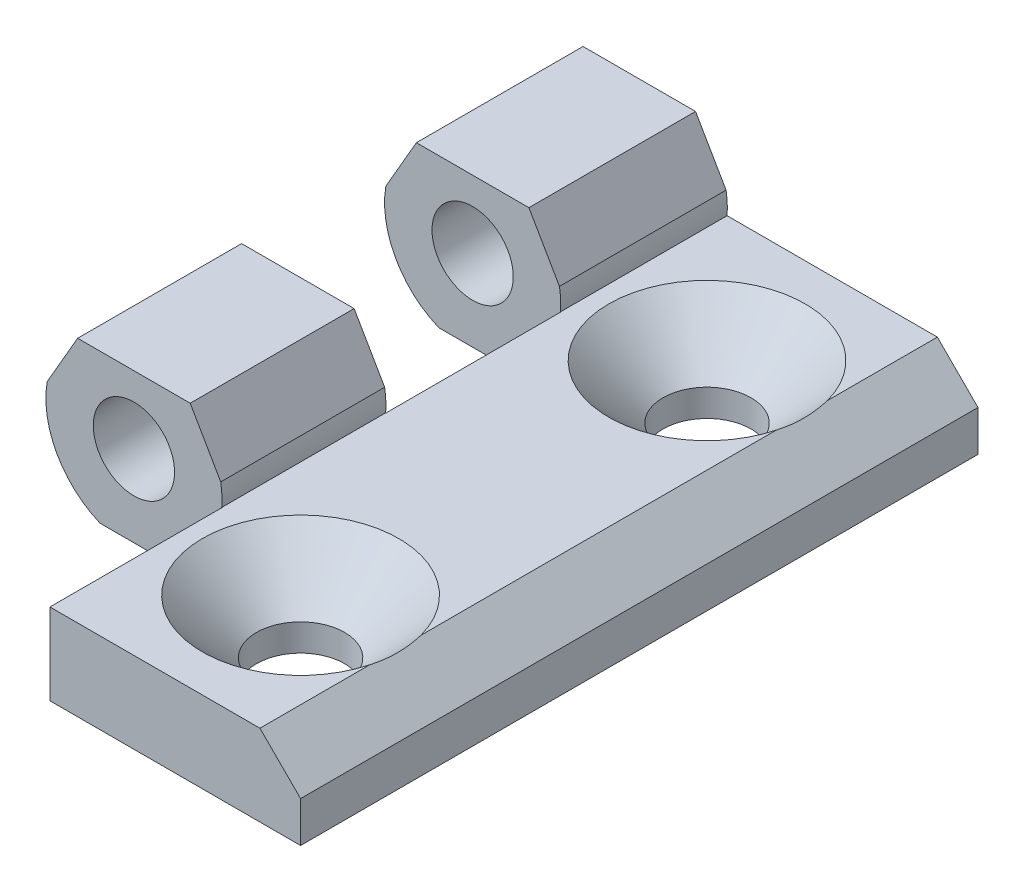
ISO-10303-21;
HEADER;
FILE_DESCRIPTION(('STEP AP214'),'2;1');
FILE_NAME('part.step','',(''),(''),'','','');
FILE_SCHEMA(('AUTOMOTIVE_DESIGN { 1 0 10303 214 1 1 1 1 }'));
ENDSEC;
DATA;
#1=APPLICATION_CONTEXT('core data for automotive mechanical design processes');
#2=APPLICATION_PROTOCOL_DEFINITION('international standard','automotive_design',2000,#1);
#3=PRODUCT_CONTEXT('',#1,'mechanical');
#4=PRODUCT('Part','Part','',(#3));
#5=PRODUCT_RELATED_PRODUCT_CATEGORY('part','',(#4));
#6=PRODUCT_DEFINITION_FORMATION('','',#4);
#7=PRODUCT_DEFINITION_CONTEXT('part definition',#1,'design');
#8=PRODUCT_DEFINITION('design','',#6,#7);
#9=PRODUCT_DEFINITION_SHAPE('','',#8);
#10=(LENGTH_UNIT() NAMED_UNIT(*) SI_UNIT(.MILLI.,.METRE.));
#11=(NAMED_UNIT(*) PLANE_ANGLE_UNIT() SI_UNIT($,.RADIAN.));
#12=(NAMED_UNIT(*) SI_UNIT($,.STERADIAN.) SOLID_ANGLE_UNIT());
#13=UNCERTAINTY_MEASURE_WITH_UNIT(LENGTH_MEASURE(1.E-05),#10,'distance_accuracy_value','');
#14=(GEOMETRIC_REPRESENTATION_CONTEXT(3) GLOBAL_UNCERTAINTY_ASSIGNED_CONTEXT((#13)) GLOBAL_UNIT_ASSIGNED_CONTEXT((#10,
#11,#12)) REPRESENTATION_CONTEXT('',''));
#15=CARTESIAN_POINT('',(0.,0.,0.));
#16=DIRECTION('',(0.,0.,1.));
#17=DIRECTION('',(1.,0.,0.));
#18=AXIS2_PLACEMENT_3D('',#15,#16,#17);
#19=CARTESIAN_POINT('',(0.,0.,25.));
#20=DIRECTION('',(0.,0.,-1.));
#21=DIRECTION('',(-1.,0.,0.));
#22=AXIS2_PLACEMENT_3D('',#19,#20,#21);
#23=CYLINDRICAL_SURFACE('',#22,6.5);
#24=DIRECTION('',(0.,0.,1.));
#25=VECTOR('',#24,1.);
#26=CARTESIAN_POINT('',(6.40678298465171,1.09687364248452,-25.));
#27=LINE('',#26,#25);
#28=CARTESIAN_POINT('',(6.40678298465171,1.09687364248452,-25.));
#29=VERTEX_POINT('',#28);
#30=CARTESIAN_POINT('',(6.40678298465172,1.09687364248452,-12.7));
#31=VERTEX_POINT('',#30);
#32=EDGE_CURVE('E319',#29,#31,#27,.T.);
#33=ORIENTED_EDGE('',*,*,#32,.T.);
#34=CARTESIAN_POINT('',(0.,0.,-12.7));
#35=DIRECTION('',(0.,0.,-1.));
#36=DIRECTION('',(-1.,0.,0.));
#37=AXIS2_PLACEMENT_3D('',#34,#35,#36);
#38=CIRCLE('',#37,6.5);
#39=CARTESIAN_POINT('',(6.48074069840786,-0.499999999999999,-12.7));
#40=VERTEX_POINT('',#39);
#41=EDGE_CURVE('E230',#31,#40,#38,.T.);
#42=ORIENTED_EDGE('',*,*,#41,.T.);
#43=DIRECTION('',(0.,0.,-1.));
#44=VECTOR('',#43,1.);
#45=CARTESIAN_POINT('',(6.48074069840786,-0.500000000000003,25.));
#46=LINE('',#45,#44);
#47=CARTESIAN_POINT('',(6.48074069840786,-0.500000000000003,-25.));
#48=VERTEX_POINT('',#47);
#49=EDGE_CURVE('E385',#40,#48,#46,.T.);
#50=ORIENTED_EDGE('',*,*,#49,.T.);
#51=CARTESIAN_POINT('',(0.,0.,-25.));
#52=DIRECTION('',(0.,0.,1.));
#53=DIRECTION('',(1.,0.,0.));
#54=AXIS2_PLACEMENT_3D('',#51,#52,#53);
#55=CIRCLE('',#54,6.5);
#56=EDGE_CURVE('E352',#48,#29,#55,.T.);
#57=ORIENTED_EDGE('',*,*,#56,.T.);
#58=EDGE_LOOP('',(#33,#42,#50,#57));
#59=FACE_BOUND('',#58,.T.);
#60=ADVANCED_FACE('F32',(#59),#23,.T.);
#61=CARTESIAN_POINT('',(-4.15331193145904,5.,25.));
#62=DIRECTION('',(0.,-1.,0.));
#63=DIRECTION('',(0.,0.,-1.));
#64=AXIS2_PLACEMENT_3D('',#61,#62,#63);
#65=PLANE('',#64);
#66=DIRECTION('',(0.,0.,-1.));
#67=VECTOR('',#66,1.);
#68=CARTESIAN_POINT('',(-4.15331193145904,5.,25.));
#69=LINE('',#68,#67);
#70=CARTESIAN_POINT('',(-4.15331193145903,5.,-12.7));
#71=VERTEX_POINT('',#70);
#72=CARTESIAN_POINT('',(-4.15331193145904,5.,-25.));
#73=VERTEX_POINT('',#72);
#74=EDGE_CURVE('E379',#71,#73,#69,.T.);
#75=ORIENTED_EDGE('',*,*,#74,.F.);
#76=DIRECTION('',(-1.,0.,0.));
#77=VECTOR('',#76,1.);
#78=CARTESIAN_POINT('',(6.5,5.,-12.7));
#79=LINE('',#78,#77);
#80=CARTESIAN_POINT('',(4.15331193145904,5.,-12.7));
#81=VERTEX_POINT('',#80);
#82=EDGE_CURVE('E225',#81,#71,#79,.T.);
#83=ORIENTED_EDGE('',*,*,#82,.F.);
#84=DIRECTION('',(0.,0.,-1.));
#85=VECTOR('',#84,1.);
#86=CARTESIAN_POINT('',(4.15331193145904,5.,25.));
#87=LINE('',#86,#85);
#88=CARTESIAN_POINT('',(4.15331193145904,5.,-25.));
#89=VERTEX_POINT('',#88);
#90=EDGE_CURVE('E382',#81,#89,#87,.T.);
#91=ORIENTED_EDGE('',*,*,#90,.T.);
#92=DIRECTION('',(-1.,0.,0.));
#93=VECTOR('',#92,1.);
#94=CARTESIAN_POINT('',(-4.15331193145904,5.,-25.));
#95=LINE('',#94,#93);
#96=EDGE_CURVE('E355',#89,#73,#95,.T.);
#97=ORIENTED_EDGE('',*,*,#96,.T.);
#98=EDGE_LOOP('',(#75,#83,#91,#97));
#99=FACE_BOUND('',#98,.T.);
#100=ADVANCED_FACE('F441',(#99),#65,.F.);
#101=CARTESIAN_POINT('',(0.,0.,25.));
#102=DIRECTION('',(0.,0.,-1.));
#103=DIRECTION('',(-1.,0.,0.));
#104=AXIS2_PLACEMENT_3D('',#101,#102,#103);
#105=CYLINDRICAL_SURFACE('',#104,6.5);
#106=CARTESIAN_POINT('',(0.,0.,-12.7));
#107=DIRECTION('',(0.,0.,-1.));
#108=DIRECTION('',(-1.,0.,0.));
#109=AXIS2_PLACEMENT_3D('',#106,#107,#108);
#110=CIRCLE('',#109,6.5);
#111=CARTESIAN_POINT('',(-2.5,-6.,-12.7));
#112=VERTEX_POINT('',#111);
#113=CARTESIAN_POINT('',(-6.40678298465171,1.09687364248452,-12.7));
#114=VERTEX_POINT('',#113);
#115=EDGE_CURVE('E238',#112,#114,#110,.T.);
#116=ORIENTED_EDGE('',*,*,#115,.T.);
#117=DIRECTION('',(0.,0.,1.));
#118=VECTOR('',#117,1.);
#119=CARTESIAN_POINT('',(-6.40678298465171,1.09687364248452,-25.));
#120=LINE('',#119,#118);
#121=CARTESIAN_POINT('',(-6.40678298465171,1.09687364248452,-25.));
#122=VERTEX_POINT('',#121);
#123=EDGE_CURVE('E312',#122,#114,#120,.T.);
#124=ORIENTED_EDGE('',*,*,#123,.F.);
#125=CARTESIAN_POINT('',(0.,0.,-25.));
#126=DIRECTION('',(0.,0.,1.));
#127=DIRECTION('',(1.,0.,0.));
#128=AXIS2_PLACEMENT_3D('',#125,#126,#127);
#129=CIRCLE('',#128,6.5);
#130=CARTESIAN_POINT('',(-2.5,-6.,-25.));
#131=VERTEX_POINT('',#130);
#132=EDGE_CURVE('E358',#122,#131,#129,.T.);
#133=ORIENTED_EDGE('',*,*,#132,.T.);
#134=DIRECTION('',(0.,0.,-1.));
#135=VECTOR('',#134,1.);
#136=CARTESIAN_POINT('',(-2.5,-6.,25.));
#137=LINE('',#136,#135);
#138=EDGE_CURVE('E376',#112,#131,#137,.T.);
#139=ORIENTED_EDGE('',*,*,#138,.F.);
#140=EDGE_LOOP('',(#116,#124,#133,#139));
#141=FACE_BOUND('',#140,.T.);
#142=ADVANCED_FACE('F447',(#141),#105,.T.);
#143=CARTESIAN_POINT('',(2.,-6.,25.));
#144=DIRECTION('',(0.,1.,0.));
#145=DIRECTION('',(0.,0.,1.));
#146=AXIS2_PLACEMENT_3D('',#143,#144,#145);
#147=PLANE('',#146);
#148=DIRECTION('',(0.,0.,-1.));
#149=VECTOR('',#148,1.);
#150=CARTESIAN_POINT('',(2.,-6.,25.));
#151=LINE('',#150,#149);
#152=CARTESIAN_POINT('',(2.,-6.,-12.7));
#153=VERTEX_POINT('',#152);
#154=CARTESIAN_POINT('',(2.,-6.,-25.));
#155=VERTEX_POINT('',#154);
#156=EDGE_CURVE('E373',#153,#155,#151,.T.);
#157=ORIENTED_EDGE('',*,*,#156,.F.);
#158=DIRECTION('',(-1.,0.,0.));
#159=VECTOR('',#158,1.);
#160=CARTESIAN_POINT('',(2.,-6.,-12.7));
#161=LINE('',#160,#159);
#162=EDGE_CURVE('E240',#153,#112,#161,.T.);
#163=ORIENTED_EDGE('',*,*,#162,.T.);
#164=ORIENTED_EDGE('',*,*,#138,.T.);
#165=DIRECTION('',(1.,0.,0.));
#166=VECTOR('',#165,1.);
#167=CARTESIAN_POINT('',(2.,-6.,-25.));
#168=LINE('',#167,#166);
#169=EDGE_CURVE('E361',#131,#155,#168,.T.);
#170=ORIENTED_EDGE('',*,*,#169,.T.);
#171=EDGE_LOOP('',(#157,#163,#164,#170));
#172=FACE_BOUND('',#171,.T.);
#173=ADVANCED_FACE('F522',(#172),#147,.F.);
#174=CARTESIAN_POINT('',(2.,-6.5,25.));
#175=DIRECTION('',(1.,0.,0.));
#176=DIRECTION('',(0.,0.,-1.));
#177=AXIS2_PLACEMENT_3D('',#174,#175,#176);
#178=PLANE('',#177);
#179=DIRECTION('',(0.,0.,-1.));
#180=VECTOR('',#179,1.);
#181=CARTESIAN_POINT('',(2.,-6.5,25.));
#182=LINE('',#181,#180);
#183=CARTESIAN_POINT('',(2.,-6.5,-12.7));
#184=VERTEX_POINT('',#183);
#185=CARTESIAN_POINT('',(2.,-6.5,-25.));
#186=VERTEX_POINT('',#185);
#187=EDGE_CURVE('E370',#184,#186,#182,.T.);
#188=ORIENTED_EDGE('',*,*,#187,.F.);
#189=DIRECTION('',(0.,1.,0.));
#190=VECTOR('',#189,1.);
#191=CARTESIAN_POINT('',(2.,-6.5,-12.7));
#192=LINE('',#191,#190);
#193=EDGE_CURVE('E224',#184,#153,#192,.T.);
#194=ORIENTED_EDGE('',*,*,#193,.T.);
#195=ORIENTED_EDGE('',*,*,#156,.T.);
#196=DIRECTION('',(0.,-1.,0.));
#197=VECTOR('',#196,1.);
#198=CARTESIAN_POINT('',(2.,-6.5,-25.));
#199=LINE('',#198,#197);
#200=EDGE_CURVE('E364',#155,#186,#199,.T.);
#201=ORIENTED_EDGE('',*,*,#200,.T.);
#202=EDGE_LOOP('',(#188,#194,#195,#201));
#203=FACE_BOUND('',#202,.T.);
#204=ADVANCED_FACE('F524',(#203),#178,.F.);
#205=CARTESIAN_POINT('',(0.,0.,25.));
#206=DIRECTION('',(0.,0.,-1.));
#207=DIRECTION('',(-1.,0.,0.));
#208=AXIS2_PLACEMENT_3D('',#205,#206,#207);
#209=CYLINDRICAL_SURFACE('',#208,3.);
#210=CARTESIAN_POINT('',(0.,0.,-12.7));
#211=DIRECTION('',(0.,0.,-1.));
#212=DIRECTION('',(-1.,0.,0.));
#213=AXIS2_PLACEMENT_3D('',#210,#211,#212);
#214=CIRCLE('',#213,3.);
#215=CARTESIAN_POINT('',(-3.,0.,-12.7));
#216=VERTEX_POINT('',#215);
#217=EDGE_CURVE('E244',#216,#216,#214,.T.);
#218=ORIENTED_EDGE('',*,*,#217,.F.);
#219=EDGE_LOOP('',(#218));
#220=FACE_BOUND('',#219,.T.);
#221=CARTESIAN_POINT('',(0.,0.,-25.));
#222=DIRECTION('',(0.,0.,1.));
#223=DIRECTION('',(1.,0.,0.));
#224=AXIS2_PLACEMENT_3D('',#221,#222,#223);
#225=CIRCLE('',#224,3.);
#226=CARTESIAN_POINT('',(3.,0.,-25.));
#227=VERTEX_POINT('',#226);
#228=EDGE_CURVE('E328',#227,#227,#225,.T.);
#229=ORIENTED_EDGE('',*,*,#228,.F.);
#230=EDGE_LOOP('',(#229));
#231=FACE_BOUND('',#230,.T.);
#232=ADVANCED_FACE('F552',(#220,#231),#209,.F.);
#233=CARTESIAN_POINT('',(6.40678298465171,1.09687364248452,-25.));
#234=DIRECTION('',(-0.86602540378444,-0.499999999999998,0.));
#235=DIRECTION('',(0.499999999999998,-0.86602540378444,0.));
#236=AXIS2_PLACEMENT_3D('',#233,#234,#235);
#237=PLANE('',#236);
#238=ORIENTED_EDGE('',*,*,#90,.F.);
#239=DIRECTION('',(0.499999999999998,-0.86602540378444,0.));
#240=VECTOR('',#239,1.);
#241=CARTESIAN_POINT('',(6.40678298465171,1.09687364248451,-12.7));
#242=LINE('',#241,#240);
#243=EDGE_CURVE('E232',#81,#31,#242,.T.);
#244=ORIENTED_EDGE('',*,*,#243,.T.);
#245=ORIENTED_EDGE('',*,*,#32,.F.);
#246=DIRECTION('',(0.499999999999998,-0.86602540378444,0.));
#247=VECTOR('',#246,1.);
#248=CARTESIAN_POINT('',(6.40678298465171,1.09687364248452,-25.));
#249=LINE('',#248,#247);
#250=EDGE_CURVE('E315',#89,#29,#249,.T.);
#251=ORIENTED_EDGE('',*,*,#250,.F.);
#252=EDGE_LOOP('',(#238,#244,#245,#251));
#253=FACE_BOUND('',#252,.T.);
#254=ADVANCED_FACE('F509',(#253),#237,.F.);
#255=CARTESIAN_POINT('',(-4.15331193145904,5.,-25.));
#256=DIRECTION('',(0.86602540378444,-0.499999999999998,0.));
#257=DIRECTION('',(0.499999999999998,0.86602540378444,0.));
#258=AXIS2_PLACEMENT_3D('',#255,#256,#257);
#259=PLANE('',#258);
#260=ORIENTED_EDGE('',*,*,#123,.T.);
#261=DIRECTION('',(0.499999999999998,0.86602540378444,0.));
#262=VECTOR('',#261,1.);
#263=CARTESIAN_POINT('',(-4.15331193145904,5.,-12.7));
#264=LINE('',#263,#262);
#265=EDGE_CURVE('E235',#114,#71,#264,.T.);
#266=ORIENTED_EDGE('',*,*,#265,.T.);
#267=ORIENTED_EDGE('',*,*,#74,.T.);
#268=DIRECTION('',(0.499999999999998,0.86602540378444,0.));
#269=VECTOR('',#268,1.);
#270=CARTESIAN_POINT('',(-4.15331193145904,5.,-25.));
#271=LINE('',#270,#269);
#272=EDGE_CURVE('E308',#122,#73,#271,.T.);
#273=ORIENTED_EDGE('',*,*,#272,.F.);
#274=EDGE_LOOP('',(#260,#266,#267,#273));
#275=FACE_BOUND('',#274,.T.);
#276=ADVANCED_FACE('F515',(#275),#259,.F.);
#277=CARTESIAN_POINT('',(0.,0.,25.));
#278=DIRECTION('',(0.,0.,1.));
#279=DIRECTION('',(1.,0.,0.));
#280=AXIS2_PLACEMENT_3D('',#277,#278,#279);
#281=PLANE('',#280);
#282=DIRECTION('',(0.,1.,0.));
#283=VECTOR('',#282,1.);
#284=CARTESIAN_POINT('',(6.5,-6.5,25.));
#285=LINE('',#284,#283);
#286=CARTESIAN_POINT('',(6.5,-6.5,25.));
#287=VERTEX_POINT('',#286);
#288=CARTESIAN_POINT('',(6.5,-0.499999999999999,25.));
#289=VERTEX_POINT('',#288);
#290=EDGE_CURVE('E303',#287,#289,#285,.T.);
#291=ORIENTED_EDGE('',*,*,#290,.F.);
#292=DIRECTION('',(1.,0.,0.));
#293=VECTOR('',#292,1.);
#294=CARTESIAN_POINT('',(25.,-6.5,25.));
#295=LINE('',#294,#293);
#296=CARTESIAN_POINT('',(25.,-6.5,25.));
#297=VERTEX_POINT('',#296);
#298=EDGE_CURVE('E341',#287,#297,#295,.T.);
#299=ORIENTED_EDGE('',*,*,#298,.T.);
#300=DIRECTION('',(0.,1.,0.));
#301=VECTOR('',#300,1.);
#302=CARTESIAN_POINT('',(25.,-6.5,25.));
#303=LINE('',#302,#301);
#304=CARTESIAN_POINT('',(25.,-3.5,25.));
#305=VERTEX_POINT('',#304);
#306=EDGE_CURVE('E332',#297,#305,#303,.T.);
#307=ORIENTED_EDGE('',*,*,#306,.T.);
#308=DIRECTION('',(-0.707106781186549,0.707106781186546,0.));
#309=VECTOR('',#308,1.);
#310=CARTESIAN_POINT('',(25.,-3.5,25.));
#311=LINE('',#310,#309);
#312=CARTESIAN_POINT('',(22.,-0.499999999999997,25.));
#313=VERTEX_POINT('',#312);
#314=EDGE_CURVE('E335',#305,#313,#311,.T.);
#315=ORIENTED_EDGE('',*,*,#314,.T.);
#316=DIRECTION('',(-1.,0.,0.));
#317=VECTOR('',#316,1.);
#318=CARTESIAN_POINT('',(22.,-0.499999999999997,25.));
#319=LINE('',#318,#317);
#320=EDGE_CURVE('E338',#313,#289,#319,.T.);
#321=ORIENTED_EDGE('',*,*,#320,.T.);
#322=EDGE_LOOP('',(#291,#299,#307,#315,#321));
#323=FACE_BOUND('',#322,.T.);
#324=ADVANCED_FACE('F491',(#323),#281,.T.);
#325=CARTESIAN_POINT('',(0.,0.,-25.));
#326=DIRECTION('',(0.,0.,1.));
#327=DIRECTION('',(1.,0.,0.));
#328=AXIS2_PLACEMENT_3D('',#325,#326,#327);
#329=PLANE('',#328);
#330=ORIENTED_EDGE('',*,*,#132,.F.);
#331=ORIENTED_EDGE('',*,*,#272,.T.);
#332=ORIENTED_EDGE('',*,*,#96,.F.);
#333=ORIENTED_EDGE('',*,*,#250,.T.);
#334=ORIENTED_EDGE('',*,*,#56,.F.);
#335=DIRECTION('',(-1.,0.,0.));
#336=VECTOR('',#335,1.);
#337=CARTESIAN_POINT('',(22.,-0.499999999999997,-25.));
#338=LINE('',#337,#336);
#339=CARTESIAN_POINT('',(22.,-0.499999999999997,-25.));
#340=VERTEX_POINT('',#339);
#341=EDGE_CURVE('E349',#340,#48,#338,.T.);
#342=ORIENTED_EDGE('',*,*,#341,.F.);
#343=DIRECTION('',(-0.707106781186549,0.707106781186546,0.));
#344=VECTOR('',#343,1.);
#345=CARTESIAN_POINT('',(25.,-3.5,-25.));
#346=LINE('',#345,#344);
#347=CARTESIAN_POINT('',(25.,-3.5,-25.));
#348=VERTEX_POINT('',#347);
#349=EDGE_CURVE('E346',#348,#340,#346,.T.);
#350=ORIENTED_EDGE('',*,*,#349,.F.);
#351=DIRECTION('',(0.,1.,0.));
#352=VECTOR('',#351,1.);
#353=CARTESIAN_POINT('',(25.,-6.5,-25.));
#354=LINE('',#353,#352);
#355=CARTESIAN_POINT('',(25.,-6.5,-25.));
#356=VERTEX_POINT('',#355);
#357=EDGE_CURVE('E331',#356,#348,#354,.T.);
#358=ORIENTED_EDGE('',*,*,#357,.F.);
#359=DIRECTION('',(1.,0.,0.));
#360=VECTOR('',#359,1.);
#361=CARTESIAN_POINT('',(25.,-6.5,-25.));
#362=LINE('',#361,#360);
#363=EDGE_CURVE('E336',#186,#356,#362,.T.);
#364=ORIENTED_EDGE('',*,*,#363,.F.);
#365=ORIENTED_EDGE('',*,*,#200,.F.);
#366=ORIENTED_EDGE('',*,*,#169,.F.);
#367=EDGE_LOOP('',(#330,#331,#332,#333,#334,#342,#350,#358,#364,#365,#366));
#368=FACE_BOUND('',#367,.T.);
#369=ORIENTED_EDGE('',*,*,#228,.T.);
#370=EDGE_LOOP('',(#369));
#371=FACE_BOUND('',#370,.T.);
#372=ADVANCED_FACE('F424',(#368,#371),#329,.F.);
#373=CARTESIAN_POINT('',(25.,-6.5,25.));
#374=DIRECTION('',(-1.,0.,0.));
#375=DIRECTION('',(0.,0.,1.));
#376=AXIS2_PLACEMENT_3D('',#373,#374,#375);
#377=PLANE('',#376);
#378=ORIENTED_EDGE('',*,*,#357,.T.);
#379=DIRECTION('',(0.,0.,-1.));
#380=VECTOR('',#379,1.);
#381=CARTESIAN_POINT('',(25.,-3.5,25.));
#382=LINE('',#381,#380);
#383=EDGE_CURVE('E392',#305,#348,#382,.T.);
#384=ORIENTED_EDGE('',*,*,#383,.F.);
#385=ORIENTED_EDGE('',*,*,#306,.F.);
#386=DIRECTION('',(0.,0.,-1.));
#387=VECTOR('',#386,1.);
#388=CARTESIAN_POINT('',(25.,-6.5,25.));
#389=LINE('',#388,#387);
#390=EDGE_CURVE('E343',#297,#356,#389,.T.);
#391=ORIENTED_EDGE('',*,*,#390,.T.);
#392=EDGE_LOOP('',(#378,#384,#385,#391));
#393=FACE_BOUND('',#392,.T.);
#394=ADVANCED_FACE('F420',(#393),#377,.F.);
#395=CARTESIAN_POINT('',(25.,-3.5,25.));
#396=DIRECTION('',(-0.707106781186546,-0.707106781186549,0.));
#397=DIRECTION('',(0.707106781186549,-0.707106781186546,0.));
#398=AXIS2_PLACEMENT_3D('',#395,#396,#397);
#399=PLANE('',#398);
#400=DIRECTION('',(0.,0.,-1.));
#401=VECTOR('',#400,1.);
#402=CARTESIAN_POINT('',(22.,-0.499999999999997,25.));
#403=LINE('',#402,#401);
#404=CARTESIAN_POINT('',(22.,-0.499999999999997,13.1125413911822));
#405=VERTEX_POINT('',#404);
#406=CARTESIAN_POINT('',(22.,-0.499999999999997,-13.1125413911822));
#407=VERTEX_POINT('',#406);
#408=EDGE_CURVE('E393',#405,#407,#403,.T.);
#409=ORIENTED_EDGE('',*,*,#408,.F.);
#410=CARTESIAN_POINT('',(22.,-0.499999999999997,13.1125413911822));
#411=CARTESIAN_POINT('',(22.0833333333333,-0.583333333333343,13.7416942607881));
#412=CARTESIAN_POINT('',(22.125,-0.625000000000017,14.3708471303941));
#413=CARTESIAN_POINT('',(22.125,-0.625000000000017,15.6291528696059));
#414=CARTESIAN_POINT('',(22.0833333333333,-0.583333333333345,16.2583057392119));
#415=CARTESIAN_POINT('',(22.,-0.499999999999999,16.8874586088178));
#416=B_SPLINE_CURVE_WITH_KNOTS('',3,(#410,#411,#412,#413,#414,#415),.UNSPECIFIED.,.F.,.F.,(4,2,
4),(0.,1.89571886101303,3.79143772202606),.UNSPECIFIED.);
#417=CARTESIAN_POINT('',(22.,-0.499999999999997,16.8874586088178));
#418=VERTEX_POINT('',#417);
#419=EDGE_CURVE('E409',#405,#418,#416,.T.);
#420=ORIENTED_EDGE('',*,*,#419,.T.);
#421=EDGE_CURVE('E389',#313,#418,#403,.T.);
#422=ORIENTED_EDGE('',*,*,#421,.F.);
#423=ORIENTED_EDGE('',*,*,#314,.F.);
#424=ORIENTED_EDGE('',*,*,#383,.T.);
#425=ORIENTED_EDGE('',*,*,#349,.T.);
#426=CARTESIAN_POINT('',(22.,-0.499999999999997,-16.8874586088178));
#427=VERTEX_POINT('',#426);
#428=EDGE_CURVE('E388',#427,#340,#403,.T.);
#429=ORIENTED_EDGE('',*,*,#428,.F.);
#430=CARTESIAN_POINT('',(22.,-0.499999999999997,-16.8874586088178));
#431=CARTESIAN_POINT('',(22.0833333333333,-0.583333333333342,-16.2583057392119));
#432=CARTESIAN_POINT('',(22.125,-0.625000000000015,-15.6291528696059));
#433=CARTESIAN_POINT('',(22.125,-0.625000000000015,-14.3708471303941));
#434=CARTESIAN_POINT('',(22.0833333333333,-0.583333333333342,-13.7416942607881));
#435=CARTESIAN_POINT('',(22.,-0.499999999999997,-13.1125413911822));
#436=B_SPLINE_CURVE_WITH_KNOTS('',3,(#430,#431,#432,#433,#434,#435),.UNSPECIFIED.,.F.,.F.,(4,2,
4),(0.,1.89571886101302,3.79143772202605),.UNSPECIFIED.);
#437=EDGE_CURVE('E47',#427,#407,#436,.T.);
#438=ORIENTED_EDGE('',*,*,#437,.T.);
#439=EDGE_LOOP('',(#409,#420,#422,#423,#424,#425,#429,#438));
#440=FACE_BOUND('',#439,.T.);
#441=ADVANCED_FACE('F414',(#440),#399,.F.);
#442=CARTESIAN_POINT('',(22.,-0.499999999999997,25.));
#443=DIRECTION('',(0.,-1.,0.));
#444=DIRECTION('',(1.,0.,0.));
#445=AXIS2_PLACEMENT_3D('',#442,#443,#444);
#446=PLANE('',#445);
#447=DIRECTION('',(1.,0.,0.));
#448=VECTOR('',#447,1.);
#449=CARTESIAN_POINT('',(22.,-0.499999999999997,-12.7));
#450=LINE('',#449,#448);
#451=CARTESIAN_POINT('',(6.5,-0.499999999999999,-12.7));
#452=VERTEX_POINT('',#451);
#453=EDGE_CURVE('E220',#40,#452,#450,.T.);
#454=ORIENTED_EDGE('',*,*,#453,.T.);
#455=DIRECTION('',(0.,0.,1.));
#456=VECTOR('',#455,1.);
#457=CARTESIAN_POINT('',(6.49999999999999,-0.499999999999999,25.));
#458=LINE('',#457,#456);
#459=CARTESIAN_POINT('',(6.5,-0.499999999999999,0.2));
#460=VERTEX_POINT('',#459);
#461=EDGE_CURVE('E211',#452,#460,#458,.T.);
#462=ORIENTED_EDGE('',*,*,#461,.T.);
#463=DIRECTION('',(-1.,0.,0.));
#464=VECTOR('',#463,1.);
#465=CARTESIAN_POINT('',(22.,-0.499999999999997,0.199999999999995));
#466=LINE('',#465,#464);
#467=CARTESIAN_POINT('',(6.48074069840786,-0.500000000000003,0.199999999999998));
#468=VERTEX_POINT('',#467);
#469=EDGE_CURVE('E295',#460,#468,#466,.T.);
#470=ORIENTED_EDGE('',*,*,#469,.T.);
#471=CARTESIAN_POINT('',(6.48074069840786,-0.500000000000003,12.3));
#472=VERTEX_POINT('',#471);
#473=EDGE_CURVE('E386',#472,#468,#46,.T.);
#474=ORIENTED_EDGE('',*,*,#473,.F.);
#475=DIRECTION('',(1.,0.,0.));
#476=VECTOR('',#475,1.);
#477=CARTESIAN_POINT('',(22.,-0.499999999999997,12.3));
#478=LINE('',#477,#476);
#479=CARTESIAN_POINT('',(6.5,-0.499999999999999,12.3));
#480=VERTEX_POINT('',#479);
#481=EDGE_CURVE('E269',#472,#480,#478,.T.);
#482=ORIENTED_EDGE('',*,*,#481,.T.);
#483=DIRECTION('',(0.,0.,1.));
#484=VECTOR('',#483,1.);
#485=CARTESIAN_POINT('',(6.5,-0.499999999999999,25.));
#486=LINE('',#485,#484);
#487=EDGE_CURVE('E305',#480,#289,#486,.T.);
#488=ORIENTED_EDGE('',*,*,#487,.T.);
#489=ORIENTED_EDGE('',*,*,#320,.F.);
#490=ORIENTED_EDGE('',*,*,#421,.T.);
#491=CARTESIAN_POINT('',(15.,-0.499999999999998,15.));
#492=DIRECTION('',(0.,-1.,0.));
#493=DIRECTION('',(1.,0.,0.));
#494=AXIS2_PLACEMENT_3D('',#491,#492,#493);
#495=CIRCLE('',#494,7.25000000000003);
#496=EDGE_CURVE('E401',#418,#405,#495,.T.);
#497=ORIENTED_EDGE('',*,*,#496,.T.);
#498=ORIENTED_EDGE('',*,*,#408,.T.);
#499=CARTESIAN_POINT('',(15.,-0.499999999999998,-15.));
#500=DIRECTION('',(0.,-1.,0.));
#501=DIRECTION('',(1.,0.,0.));
#502=AXIS2_PLACEMENT_3D('',#499,#500,#501);
#503=CIRCLE('',#502,7.25000000000003);
#504=EDGE_CURVE('E399',#407,#427,#503,.T.);
#505=ORIENTED_EDGE('',*,*,#504,.T.);
#506=ORIENTED_EDGE('',*,*,#428,.T.);
#507=ORIENTED_EDGE('',*,*,#341,.T.);
#508=ORIENTED_EDGE('',*,*,#49,.F.);
#509=EDGE_LOOP('',(#454,#462,#470,#474,#482,#488,#489,#490,#497,#498,#505,#506,#507,#508));
#510=FACE_BOUND('',#509,.T.);
#511=ADVANCED_FACE('F419',(#510),#446,.F.);
#512=CARTESIAN_POINT('',(6.40678298465171,1.09687364248452,0.199999999999999));
#513=VERTEX_POINT('',#512);
#514=CARTESIAN_POINT('',(6.40678298465171,1.09687364248452,12.3));
#515=VERTEX_POINT('',#514);
#516=EDGE_CURVE('E318',#513,#515,#27,.T.);
#517=ORIENTED_EDGE('',*,*,#516,.T.);
#518=CARTESIAN_POINT('',(0.,0.,12.3));
#519=DIRECTION('',(0.,0.,-1.));
#520=DIRECTION('',(-1.,0.,0.));
#521=AXIS2_PLACEMENT_3D('',#518,#519,#520);
#522=CIRCLE('',#521,6.5);
#523=EDGE_CURVE('E266',#515,#472,#522,.T.);
#524=ORIENTED_EDGE('',*,*,#523,.T.);
#525=ORIENTED_EDGE('',*,*,#473,.T.);
#526=CARTESIAN_POINT('',(0.,0.,0.199999999999999));
#527=DIRECTION('',(0.,0.,1.));
#528=DIRECTION('',(1.,0.,0.));
#529=AXIS2_PLACEMENT_3D('',#526,#527,#528);
#530=CIRCLE('',#529,6.5);
#531=EDGE_CURVE('E293',#468,#513,#530,.T.);
#532=ORIENTED_EDGE('',*,*,#531,.T.);
#533=EDGE_LOOP('',(#517,#524,#525,#532));
#534=FACE_BOUND('',#533,.T.);
#535=ADVANCED_FACE('F443',(#534),#23,.T.);
#536=CARTESIAN_POINT('',(-4.15331193145903,5.,12.3));
#537=VERTEX_POINT('',#536);
#538=CARTESIAN_POINT('',(-4.15331193145903,5.,0.200000000000001));
#539=VERTEX_POINT('',#538);
#540=EDGE_CURVE('E380',#537,#539,#69,.T.);
#541=ORIENTED_EDGE('',*,*,#540,.F.);
#542=DIRECTION('',(-1.,0.,0.));
#543=VECTOR('',#542,1.);
#544=CARTESIAN_POINT('',(6.5,5.,12.3));
#545=LINE('',#544,#543);
#546=CARTESIAN_POINT('',(4.15331193145904,5.,12.3));
#547=VERTEX_POINT('',#546);
#548=EDGE_CURVE('E247',#547,#537,#545,.T.);
#549=ORIENTED_EDGE('',*,*,#548,.F.);
#550=CARTESIAN_POINT('',(4.15331193145904,5.,0.2));
#551=VERTEX_POINT('',#550);
#552=EDGE_CURVE('E383',#547,#551,#87,.T.);
#553=ORIENTED_EDGE('',*,*,#552,.T.);
#554=DIRECTION('',(1.,0.,0.));
#555=VECTOR('',#554,1.);
#556=CARTESIAN_POINT('',(6.5,5.,0.2));
#557=LINE('',#556,#555);
#558=EDGE_CURVE('E275',#539,#551,#557,.T.);
#559=ORIENTED_EDGE('',*,*,#558,.F.);
#560=EDGE_LOOP('',(#541,#549,#553,#559));
#561=FACE_BOUND('',#560,.T.);
#562=ADVANCED_FACE('F450',(#561),#65,.F.);
#563=CARTESIAN_POINT('',(0.,0.,12.3));
#564=DIRECTION('',(0.,0.,-1.));
#565=DIRECTION('',(-1.,0.,0.));
#566=AXIS2_PLACEMENT_3D('',#563,#564,#565);
#567=CIRCLE('',#566,6.5);
#568=CARTESIAN_POINT('',(-2.5,-6.,12.3));
#569=VERTEX_POINT('',#568);
#570=CARTESIAN_POINT('',(-6.40678298465171,1.09687364248452,12.3));
#571=VERTEX_POINT('',#570);
#572=EDGE_CURVE('E255',#569,#571,#567,.T.);
#573=ORIENTED_EDGE('',*,*,#572,.T.);
#574=CARTESIAN_POINT('',(-6.40678298465171,1.09687364248452,0.199999999999999));
#575=VERTEX_POINT('',#574);
#576=EDGE_CURVE('E311',#575,#571,#120,.T.);
#577=ORIENTED_EDGE('',*,*,#576,.F.);
#578=CARTESIAN_POINT('',(0.,0.,0.199999999999999));
#579=DIRECTION('',(0.,0.,1.));
#580=DIRECTION('',(1.,0.,0.));
#581=AXIS2_PLACEMENT_3D('',#578,#579,#580);
#582=CIRCLE('',#581,6.5);
#583=CARTESIAN_POINT('',(-2.5,-6.,0.199999999999999));
#584=VERTEX_POINT('',#583);
#585=EDGE_CURVE('E281',#575,#584,#582,.T.);
#586=ORIENTED_EDGE('',*,*,#585,.T.);
#587=EDGE_CURVE('E377',#569,#584,#137,.T.);
#588=ORIENTED_EDGE('',*,*,#587,.F.);
#589=EDGE_LOOP('',(#573,#577,#586,#588));
#590=FACE_BOUND('',#589,.T.);
#591=ADVANCED_FACE('F457',(#590),#105,.T.);
#592=CARTESIAN_POINT('',(2.,-6.,12.3));
#593=VERTEX_POINT('',#592);
#594=CARTESIAN_POINT('',(2.,-6.,0.199999999999999));
#595=VERTEX_POINT('',#594);
#596=EDGE_CURVE('E374',#593,#595,#151,.T.);
#597=ORIENTED_EDGE('',*,*,#596,.F.);
#598=DIRECTION('',(-1.,0.,0.));
#599=VECTOR('',#598,1.);
#600=CARTESIAN_POINT('',(2.,-6.,12.3));
#601=LINE('',#600,#599);
#602=EDGE_CURVE('E257',#593,#569,#601,.T.);
#603=ORIENTED_EDGE('',*,*,#602,.T.);
#604=ORIENTED_EDGE('',*,*,#587,.T.);
#605=DIRECTION('',(1.,0.,0.));
#606=VECTOR('',#605,1.);
#607=CARTESIAN_POINT('',(2.,-6.,0.199999999999999));
#608=LINE('',#607,#606);
#609=EDGE_CURVE('E284',#584,#595,#608,.T.);
#610=ORIENTED_EDGE('',*,*,#609,.T.);
#611=EDGE_LOOP('',(#597,#603,#604,#610));
#612=FACE_BOUND('',#611,.T.);
#613=ADVANCED_FACE('F535',(#612),#147,.F.);
#614=CARTESIAN_POINT('',(2.,-6.5,12.3));
#615=VERTEX_POINT('',#614);
#616=CARTESIAN_POINT('',(2.,-6.5,0.200000000000001));
#617=VERTEX_POINT('',#616);
#618=EDGE_CURVE('E371',#615,#617,#182,.T.);
#619=ORIENTED_EDGE('',*,*,#618,.F.);
#620=DIRECTION('',(0.,1.,0.));
#621=VECTOR('',#620,1.);
#622=CARTESIAN_POINT('',(2.,-6.5,12.3));
#623=LINE('',#622,#621);
#624=EDGE_CURVE('E260',#615,#593,#623,.T.);
#625=ORIENTED_EDGE('',*,*,#624,.T.);
#626=ORIENTED_EDGE('',*,*,#596,.T.);
#627=DIRECTION('',(0.,-1.,0.));
#628=VECTOR('',#627,1.);
#629=CARTESIAN_POINT('',(2.,-6.5,0.199999999999999));
#630=LINE('',#629,#628);
#631=EDGE_CURVE('E287',#595,#617,#630,.T.);
#632=ORIENTED_EDGE('',*,*,#631,.T.);
#633=EDGE_LOOP('',(#619,#625,#626,#632));
#634=FACE_BOUND('',#633,.T.);
#635=ADVANCED_FACE('F532',(#634),#178,.F.);
#636=CARTESIAN_POINT('',(25.,-6.5,25.));
#637=DIRECTION('',(0.,1.,0.));
#638=DIRECTION('',(-1.,0.,0.));
#639=AXIS2_PLACEMENT_3D('',#636,#637,#638);
#640=PLANE('',#639);
#641=CARTESIAN_POINT('',(15.,-6.5,15.));
#642=DIRECTION('',(0.,1.,0.));
#643=DIRECTION('',(-1.,0.,0.));
#644=AXIS2_PLACEMENT_3D('',#641,#642,#643);
#645=CIRCLE('',#644,3.25);
#646=CARTESIAN_POINT('',(11.75,-6.5,15.));
#647=VERTEX_POINT('',#646);
#648=EDGE_CURVE('E322',#647,#647,#645,.T.);
#649=ORIENTED_EDGE('',*,*,#648,.T.);
#650=EDGE_LOOP('',(#649));
#651=FACE_BOUND('',#650,.T.);
#652=CARTESIAN_POINT('',(15.,-6.5,-15.));
#653=DIRECTION('',(0.,1.,0.));
#654=DIRECTION('',(-1.,0.,0.));
#655=AXIS2_PLACEMENT_3D('',#652,#653,#654);
#656=CIRCLE('',#655,3.25);
#657=CARTESIAN_POINT('',(11.75,-6.5,-15.));
#658=VERTEX_POINT('',#657);
#659=EDGE_CURVE('E325',#658,#658,#656,.T.);
#660=ORIENTED_EDGE('',*,*,#659,.T.);
#661=EDGE_LOOP('',(#660));
#662=FACE_BOUND('',#661,.T.);
#663=DIRECTION('',(0.,0.,-1.));
#664=VECTOR('',#663,1.);
#665=CARTESIAN_POINT('',(6.5,-6.5,-12.5));
#666=LINE('',#665,#664);
#667=CARTESIAN_POINT('',(6.5,-6.5,0.2));
#668=VERTEX_POINT('',#667);
#669=CARTESIAN_POINT('',(6.5,-6.5,-12.7));
#670=VERTEX_POINT('',#669);
#671=EDGE_CURVE('E200',#668,#670,#666,.T.);
#672=ORIENTED_EDGE('',*,*,#671,.T.);
#673=DIRECTION('',(-1.,0.,0.));
#674=VECTOR('',#673,1.);
#675=CARTESIAN_POINT('',(6.5,-6.5,-12.7));
#676=LINE('',#675,#674);
#677=EDGE_CURVE('E204',#670,#184,#676,.T.);
#678=ORIENTED_EDGE('',*,*,#677,.T.);
#679=ORIENTED_EDGE('',*,*,#187,.T.);
#680=ORIENTED_EDGE('',*,*,#363,.T.);
#681=ORIENTED_EDGE('',*,*,#390,.F.);
#682=ORIENTED_EDGE('',*,*,#298,.F.);
#683=DIRECTION('',(0.,0.,-1.));
#684=VECTOR('',#683,1.);
#685=CARTESIAN_POINT('',(6.5,-6.5,25.));
#686=LINE('',#685,#684);
#687=CARTESIAN_POINT('',(6.5,-6.5,12.3));
#688=VERTEX_POINT('',#687);
#689=EDGE_CURVE('E301',#287,#688,#686,.T.);
#690=ORIENTED_EDGE('',*,*,#689,.T.);
#691=DIRECTION('',(-1.,0.,0.));
#692=VECTOR('',#691,1.);
#693=CARTESIAN_POINT('',(6.5,-6.5,12.3));
#694=LINE('',#693,#692);
#695=EDGE_CURVE('E248',#688,#615,#694,.T.);
#696=ORIENTED_EDGE('',*,*,#695,.T.);
#697=ORIENTED_EDGE('',*,*,#618,.T.);
#698=DIRECTION('',(1.,0.,0.));
#699=VECTOR('',#698,1.);
#700=CARTESIAN_POINT('',(6.5,-6.5,0.2));
#701=LINE('',#700,#699);
#702=EDGE_CURVE('E207',#617,#668,#701,.T.);
#703=ORIENTED_EDGE('',*,*,#702,.T.);
#704=EDGE_LOOP('',(#672,#678,#679,#680,#681,#682,#690,#696,#697,#703));
#705=FACE_BOUND('',#704,.T.);
#706=ADVANCED_FACE('F202',(#651,#662,#705),#640,.F.);
#707=CARTESIAN_POINT('',(0.,0.,12.3));
#708=DIRECTION('',(0.,0.,-1.));
#709=DIRECTION('',(-1.,0.,0.));
#710=AXIS2_PLACEMENT_3D('',#707,#708,#709);
#711=CIRCLE('',#710,3.);
#712=CARTESIAN_POINT('',(-3.,0.,12.3));
#713=VERTEX_POINT('',#712);
#714=EDGE_CURVE('E272',#713,#713,#711,.T.);
#715=ORIENTED_EDGE('',*,*,#714,.F.);
#716=EDGE_LOOP('',(#715));
#717=FACE_BOUND('',#716,.T.);
#718=CARTESIAN_POINT('',(0.,0.,0.199999999999999));
#719=DIRECTION('',(0.,0.,1.));
#720=DIRECTION('',(1.,0.,0.));
#721=AXIS2_PLACEMENT_3D('',#718,#719,#720);
#722=CIRCLE('',#721,3.);
#723=CARTESIAN_POINT('',(3.,0.,0.199999999999998));
#724=VERTEX_POINT('',#723);
#725=EDGE_CURVE('E212',#724,#724,#722,.T.);
#726=ORIENTED_EDGE('',*,*,#725,.F.);
#727=EDGE_LOOP('',(#726));
#728=FACE_BOUND('',#727,.T.);
#729=ADVANCED_FACE('F558',(#717,#728),#209,.F.);
#730=CARTESIAN_POINT('',(15.,-6.5,-15.));
#731=DIRECTION('',(0.,1.,0.));
#732=DIRECTION('',(-1.,0.,0.));
#733=AXIS2_PLACEMENT_3D('',#730,#731,#732);
#734=CYLINDRICAL_SURFACE('',#733,3.25);
#735=CARTESIAN_POINT('',(15.,-4.50000000000001,-15.));
#736=DIRECTION('',(0.,-1.,0.));
#737=DIRECTION('',(0.,0.,-1.));
#738=AXIS2_PLACEMENT_3D('',#735,#736,#737);
#739=CIRCLE('',#738,3.25);
#740=CARTESIAN_POINT('',(15.,-4.50000000000001,-18.25));
#741=VERTEX_POINT('',#740);
#742=EDGE_CURVE('E482',#741,#741,#739,.F.);
#743=ORIENTED_EDGE('',*,*,#742,.T.);
#744=EDGE_LOOP('',(#743));
#745=FACE_BOUND('',#744,.T.);
#746=ORIENTED_EDGE('',*,*,#659,.F.);
#747=EDGE_LOOP('',(#746));
#748=FACE_BOUND('',#747,.T.);
#749=ADVANCED_FACE('F436',(#745,#748),#734,.F.);
#750=CARTESIAN_POINT('',(15.,-6.5,15.));
#751=DIRECTION('',(0.,1.,0.));
#752=DIRECTION('',(-1.,0.,0.));
#753=AXIS2_PLACEMENT_3D('',#750,#751,#752);
#754=CYLINDRICAL_SURFACE('',#753,3.25);
#755=CARTESIAN_POINT('',(15.,-4.50000000000001,15.));
#756=DIRECTION('',(0.,-1.,0.));
#757=DIRECTION('',(0.,0.,-1.));
#758=AXIS2_PLACEMENT_3D('',#755,#756,#757);
#759=CIRCLE('',#758,3.25);
#760=CARTESIAN_POINT('',(15.,-4.50000000000001,11.75));
#761=VERTEX_POINT('',#760);
#762=EDGE_CURVE('E396',#761,#761,#759,.F.);
#763=ORIENTED_EDGE('',*,*,#762,.T.);
#764=EDGE_LOOP('',(#763));
#765=FACE_BOUND('',#764,.T.);
#766=ORIENTED_EDGE('',*,*,#648,.F.);
#767=EDGE_LOOP('',(#766));
#768=FACE_BOUND('',#767,.T.);
#769=ADVANCED_FACE('F429',(#765,#768),#754,.F.);
#770=CARTESIAN_POINT('',(15.,-4.50000000000001,15.));
#771=DIRECTION('',(0.,1.,0.));
#772=DIRECTION('',(0.,0.,1.));
#773=AXIS2_PLACEMENT_3D('',#770,#771,#772);
#774=CONICAL_SURFACE('',#773,3.25,0.785398163397451);
#775=ORIENTED_EDGE('',*,*,#419,.F.);
#776=ORIENTED_EDGE('',*,*,#496,.F.);
#777=EDGE_LOOP('',(#775,#776));
#778=FACE_BOUND('',#777,.T.);
#779=ORIENTED_EDGE('',*,*,#762,.F.);
#780=EDGE_LOOP('',(#779));
#781=FACE_BOUND('',#780,.T.);
#782=ADVANCED_FACE('F426',(#778,#781),#774,.F.);
#783=CARTESIAN_POINT('',(15.,-4.50000000000001,-15.));
#784=DIRECTION('',(0.,1.,0.));
#785=DIRECTION('',(0.,0.,1.));
#786=AXIS2_PLACEMENT_3D('',#783,#784,#785);
#787=CONICAL_SURFACE('',#786,3.25,0.78539816339745);
#788=ORIENTED_EDGE('',*,*,#437,.F.);
#789=ORIENTED_EDGE('',*,*,#504,.F.);
#790=EDGE_LOOP('',(#788,#789));
#791=FACE_BOUND('',#790,.T.);
#792=ORIENTED_EDGE('',*,*,#742,.F.);
#793=EDGE_LOOP('',(#792));
#794=FACE_BOUND('',#793,.T.);
#795=ADVANCED_FACE('F34',(#791,#794),#787,.F.);
#796=ORIENTED_EDGE('',*,*,#552,.F.);
#797=DIRECTION('',(0.499999999999998,-0.86602540378444,0.));
#798=VECTOR('',#797,1.);
#799=CARTESIAN_POINT('',(6.40678298465171,1.09687364248451,12.3));
#800=LINE('',#799,#798);
#801=EDGE_CURVE('E263',#547,#515,#800,.T.);
#802=ORIENTED_EDGE('',*,*,#801,.T.);
#803=ORIENTED_EDGE('',*,*,#516,.F.);
#804=DIRECTION('',(-0.499999999999998,0.86602540378444,0.));
#805=VECTOR('',#804,1.);
#806=CARTESIAN_POINT('',(6.40678298465171,1.09687364248451,0.199999999999999));
#807=LINE('',#806,#805);
#808=EDGE_CURVE('E290',#513,#551,#807,.T.);
#809=ORIENTED_EDGE('',*,*,#808,.T.);
#810=EDGE_LOOP('',(#796,#802,#803,#809));
#811=FACE_BOUND('',#810,.T.);
#812=ADVANCED_FACE('F435',(#811),#237,.F.);
#813=ORIENTED_EDGE('',*,*,#576,.T.);
#814=DIRECTION('',(0.499999999999998,0.86602540378444,0.));
#815=VECTOR('',#814,1.);
#816=CARTESIAN_POINT('',(-4.15331193145904,5.,12.3));
#817=LINE('',#816,#815);
#818=EDGE_CURVE('E11',#571,#537,#817,.T.);
#819=ORIENTED_EDGE('',*,*,#818,.T.);
#820=ORIENTED_EDGE('',*,*,#540,.T.);
#821=DIRECTION('',(-0.499999999999998,-0.86602540378444,0.));
#822=VECTOR('',#821,1.);
#823=CARTESIAN_POINT('',(-4.15331193145904,5.,0.199999999999999));
#824=LINE('',#823,#822);
#825=EDGE_CURVE('E41',#539,#575,#824,.T.);
#826=ORIENTED_EDGE('',*,*,#825,.T.);
#827=EDGE_LOOP('',(#813,#819,#820,#826));
#828=FACE_BOUND('',#827,.T.);
#829=ADVANCED_FACE('F477',(#828),#259,.F.);
#830=CARTESIAN_POINT('',(6.5,-6.5,25.));
#831=DIRECTION('',(1.,0.,0.));
#832=DIRECTION('',(0.,0.,-1.));
#833=AXIS2_PLACEMENT_3D('',#830,#831,#832);
#834=PLANE('',#833);
#835=ORIENTED_EDGE('',*,*,#487,.F.);
#836=DIRECTION('',(0.,1.,0.));
#837=VECTOR('',#836,1.);
#838=CARTESIAN_POINT('',(6.5,-6.5,12.3));
#839=LINE('',#838,#837);
#840=EDGE_CURVE('E251',#688,#480,#839,.T.);
#841=ORIENTED_EDGE('',*,*,#840,.F.);
#842=ORIENTED_EDGE('',*,*,#689,.F.);
#843=ORIENTED_EDGE('',*,*,#290,.T.);
#844=EDGE_LOOP('',(#835,#841,#842,#843));
#845=FACE_BOUND('',#844,.T.);
#846=ADVANCED_FACE('F529',(#845),#834,.F.);
#847=CARTESIAN_POINT('',(6.5,-6.5,-12.5));
#848=DIRECTION('',(1.,0.,0.));
#849=DIRECTION('',(0.,0.,-1.));
#850=AXIS2_PLACEMENT_3D('',#847,#848,#849);
#851=PLANE('',#850);
#852=ORIENTED_EDGE('',*,*,#461,.F.);
#853=DIRECTION('',(0.,1.,0.));
#854=VECTOR('',#853,1.);
#855=CARTESIAN_POINT('',(6.5,-6.5,-12.7));
#856=LINE('',#855,#854);
#857=EDGE_CURVE('E215',#670,#452,#856,.T.);
#858=ORIENTED_EDGE('',*,*,#857,.F.);
#859=ORIENTED_EDGE('',*,*,#671,.F.);
#860=DIRECTION('',(0.,1.,0.));
#861=VECTOR('',#860,1.);
#862=CARTESIAN_POINT('',(6.5,-6.5,0.2));
#863=LINE('',#862,#861);
#864=EDGE_CURVE('E277',#668,#460,#863,.T.);
#865=ORIENTED_EDGE('',*,*,#864,.T.);
#866=EDGE_LOOP('',(#852,#858,#859,#865));
#867=FACE_BOUND('',#866,.T.);
#868=ADVANCED_FACE('F216',(#867),#851,.F.);
#869=CARTESIAN_POINT('',(6.5,-6.5,0.2));
#870=DIRECTION('',(0.,0.,1.));
#871=DIRECTION('',(1.,0.,0.));
#872=AXIS2_PLACEMENT_3D('',#869,#870,#871);
#873=PLANE('',#872);
#874=ORIENTED_EDGE('',*,*,#725,.T.);
#875=EDGE_LOOP('',(#874));
#876=FACE_BOUND('',#875,.T.);
#877=ORIENTED_EDGE('',*,*,#864,.F.);
#878=ORIENTED_EDGE('',*,*,#702,.F.);
#879=ORIENTED_EDGE('',*,*,#631,.F.);
#880=ORIENTED_EDGE('',*,*,#609,.F.);
#881=ORIENTED_EDGE('',*,*,#585,.F.);
#882=ORIENTED_EDGE('',*,*,#825,.F.);
#883=ORIENTED_EDGE('',*,*,#558,.T.);
#884=ORIENTED_EDGE('',*,*,#808,.F.);
#885=ORIENTED_EDGE('',*,*,#531,.F.);
#886=ORIENTED_EDGE('',*,*,#469,.F.);
#887=EDGE_LOOP('',(#877,#878,#879,#880,#881,#882,#883,#884,#885,#886));
#888=FACE_BOUND('',#887,.T.);
#889=ADVANCED_FACE('F480',(#876,#888),#873,.F.);
#890=CARTESIAN_POINT('',(6.5,-6.5,12.3));
#891=DIRECTION('',(0.,0.,-1.));
#892=DIRECTION('',(-1.,0.,0.));
#893=AXIS2_PLACEMENT_3D('',#890,#891,#892);
#894=PLANE('',#893);
#895=ORIENTED_EDGE('',*,*,#714,.T.);
#896=EDGE_LOOP('',(#895));
#897=FACE_BOUND('',#896,.T.);
#898=ORIENTED_EDGE('',*,*,#523,.F.);
#899=ORIENTED_EDGE('',*,*,#801,.F.);
#900=ORIENTED_EDGE('',*,*,#548,.T.);
#901=ORIENTED_EDGE('',*,*,#818,.F.);
#902=ORIENTED_EDGE('',*,*,#572,.F.);
#903=ORIENTED_EDGE('',*,*,#602,.F.);
#904=ORIENTED_EDGE('',*,*,#624,.F.);
#905=ORIENTED_EDGE('',*,*,#695,.F.);
#906=ORIENTED_EDGE('',*,*,#840,.T.);
#907=ORIENTED_EDGE('',*,*,#481,.F.);
#908=EDGE_LOOP('',(#898,#899,#900,#901,#902,#903,#904,#905,#906,#907));
#909=FACE_BOUND('',#908,.T.);
#910=ADVANCED_FACE('F469',(#897,#909),#894,.F.);
#911=CARTESIAN_POINT('',(6.5,-6.5,-12.7));
#912=DIRECTION('',(0.,0.,-1.));
#913=DIRECTION('',(-1.,0.,0.));
#914=AXIS2_PLACEMENT_3D('',#911,#912,#913);
#915=PLANE('',#914);
#916=ORIENTED_EDGE('',*,*,#217,.T.);
#917=EDGE_LOOP('',(#916));
#918=FACE_BOUND('',#917,.T.);
#919=ORIENTED_EDGE('',*,*,#677,.F.);
#920=ORIENTED_EDGE('',*,*,#857,.T.);
#921=ORIENTED_EDGE('',*,*,#453,.F.);
#922=ORIENTED_EDGE('',*,*,#41,.F.);
#923=ORIENTED_EDGE('',*,*,#243,.F.);
#924=ORIENTED_EDGE('',*,*,#82,.T.);
#925=ORIENTED_EDGE('',*,*,#265,.F.);
#926=ORIENTED_EDGE('',*,*,#115,.F.);
#927=ORIENTED_EDGE('',*,*,#162,.F.);
#928=ORIENTED_EDGE('',*,*,#193,.F.);
#929=EDGE_LOOP('',(#919,#920,#921,#922,#923,#924,#925,#926,#927,#928));
#930=FACE_BOUND('',#929,.T.);
#931=ADVANCED_FACE('F222',(#918,#930),#915,.F.);
#932=CLOSED_SHELL('',(#60,#100,#142,#173,#204,#232,#254,#276,#324,#372,#394,#441,#511,#535,#562,
#591,#613,#635,#706,#729,#749,#769,#782,#795,#812,#829,#846,#868,#889,#910,#931));
#933=MANIFOLD_SOLID_BREP('B2',#932);
#934=ADVANCED_BREP_SHAPE_REPRESENTATION('',(#18,#933),#14);
#935=SHAPE_DEFINITION_REPRESENTATION(#9,#934);
ENDSEC;
END-ISO-10303-21;
